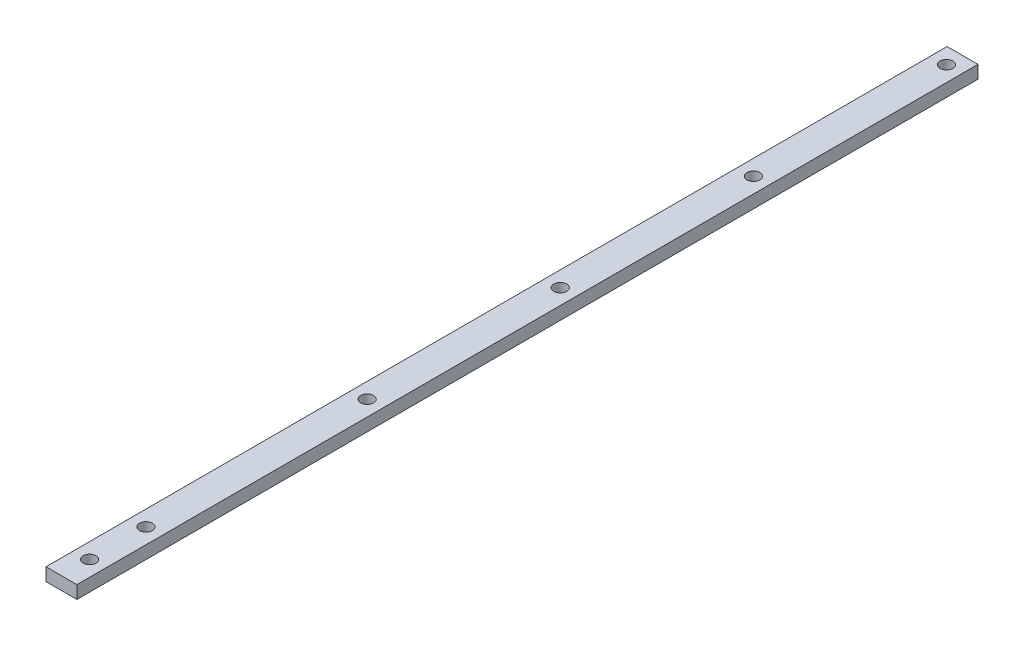
ISO-10303-21;
HEADER;
FILE_DESCRIPTION(('STEP AP214'),'2;1');
FILE_NAME('part.step','',(''),(''),'','','');
FILE_SCHEMA(('AUTOMOTIVE_DESIGN { 1 0 10303 214 1 1 1 1 }'));
ENDSEC;
DATA;
#1=APPLICATION_CONTEXT('core data for automotive mechanical design processes');
#2=APPLICATION_PROTOCOL_DEFINITION('international standard','automotive_design',2000,#1);
#3=PRODUCT_CONTEXT('',#1,'mechanical');
#4=PRODUCT('Part','Part','',(#3));
#5=PRODUCT_RELATED_PRODUCT_CATEGORY('part','',(#4));
#6=PRODUCT_DEFINITION_FORMATION('','',#4);
#7=PRODUCT_DEFINITION_CONTEXT('part definition',#1,'design');
#8=PRODUCT_DEFINITION('design','',#6,#7);
#9=PRODUCT_DEFINITION_SHAPE('','',#8);
#10=(LENGTH_UNIT() NAMED_UNIT(*) SI_UNIT(.MILLI.,.METRE.));
#11=(NAMED_UNIT(*) PLANE_ANGLE_UNIT() SI_UNIT($,.RADIAN.));
#12=(NAMED_UNIT(*) SI_UNIT($,.STERADIAN.) SOLID_ANGLE_UNIT());
#13=UNCERTAINTY_MEASURE_WITH_UNIT(LENGTH_MEASURE(1.E-05),#10,'distance_accuracy_value','');
#14=(GEOMETRIC_REPRESENTATION_CONTEXT(3) GLOBAL_UNCERTAINTY_ASSIGNED_CONTEXT((#13)) GLOBAL_UNIT_ASSIGNED_CONTEXT((#10,
#11,#12)) REPRESENTATION_CONTEXT('',''));
#15=CARTESIAN_POINT('',(0.,0.,0.));
#16=DIRECTION('',(0.,0.,1.));
#17=DIRECTION('',(1.,0.,0.));
#18=AXIS2_PLACEMENT_3D('',#15,#16,#17);
#19=CARTESIAN_POINT('',(-56.5626148851493,-2.09999999999995,-41.4745215954879));
#20=DIRECTION('',(0.,-1.,0.));
#21=DIRECTION('',(-1.,0.,0.));
#22=AXIS2_PLACEMENT_3D('',#19,#20,#21);
#23=CYLINDRICAL_SURFACE('',#22,1.);
#24=CARTESIAN_POINT('',(-56.5626148851493,-0.099999999999951,-41.4745215954879));
#25=DIRECTION('',(0.,-1.,0.));
#26=DIRECTION('',(-1.,0.,0.));
#27=AXIS2_PLACEMENT_3D('',#24,#25,#26);
#28=CIRCLE('',#27,1.);
#29=CARTESIAN_POINT('',(-55.5626148851493,-0.0999999999999504,-41.4745215954879));
#30=VERTEX_POINT('',#29);
#31=EDGE_CURVE('E33',#30,#30,#28,.T.);
#32=ORIENTED_EDGE('',*,*,#31,.F.);
#33=EDGE_LOOP('',(#32));
#34=FACE_BOUND('',#33,.T.);
#35=CARTESIAN_POINT('',(-56.5626148851493,-2.09999999999995,-41.4745215954879));
#36=DIRECTION('',(0.,-1.,0.));
#37=DIRECTION('',(-1.,0.,0.));
#38=AXIS2_PLACEMENT_3D('',#35,#36,#37);
#39=CIRCLE('',#38,1.);
#40=CARTESIAN_POINT('',(-55.5626148851493,-2.09999999999995,-41.4745215954879));
#41=VERTEX_POINT('',#40);
#42=EDGE_CURVE('E11',#41,#41,#39,.T.);
#43=ORIENTED_EDGE('',*,*,#42,.T.);
#44=EDGE_LOOP('',(#43));
#45=FACE_BOUND('',#44,.T.);
#46=ADVANCED_FACE('F16',(#34,#45),#23,.F.);
#47=CARTESIAN_POINT('',(-56.5626148851493,-2.09999999999995,-32.7245215954879));
#48=DIRECTION('',(0.,-1.,0.));
#49=DIRECTION('',(-1.,0.,0.));
#50=AXIS2_PLACEMENT_3D('',#47,#48,#49);
#51=CYLINDRICAL_SURFACE('',#50,1.);
#52=CARTESIAN_POINT('',(-56.5626148851493,-0.099999999999951,-32.7245215954879));
#53=DIRECTION('',(0.,-1.,0.));
#54=DIRECTION('',(-1.,0.,0.));
#55=AXIS2_PLACEMENT_3D('',#52,#53,#54);
#56=CIRCLE('',#55,1.);
#57=CARTESIAN_POINT('',(-55.5626148851493,-0.0999999999999504,-32.7245215954879));
#58=VERTEX_POINT('',#57);
#59=EDGE_CURVE('E129',#58,#58,#56,.T.);
#60=ORIENTED_EDGE('',*,*,#59,.F.);
#61=EDGE_LOOP('',(#60));
#62=FACE_BOUND('',#61,.T.);
#63=CARTESIAN_POINT('',(-56.5626148851493,-2.09999999999995,-32.7245215954879));
#64=DIRECTION('',(0.,-1.,0.));
#65=DIRECTION('',(-1.,0.,0.));
#66=AXIS2_PLACEMENT_3D('',#63,#64,#65);
#67=CIRCLE('',#66,1.);
#68=CARTESIAN_POINT('',(-55.5626148851493,-2.09999999999995,-32.7245215954879));
#69=VERTEX_POINT('',#68);
#70=EDGE_CURVE('E26',#69,#69,#67,.T.);
#71=ORIENTED_EDGE('',*,*,#70,.T.);
#72=EDGE_LOOP('',(#71));
#73=FACE_BOUND('',#72,.T.);
#74=ADVANCED_FACE('F184',(#62,#73),#51,.F.);
#75=CARTESIAN_POINT('',(-56.5626148851493,-2.09999999999995,-75.849521595488));
#76=DIRECTION('',(0.,-1.,0.));
#77=DIRECTION('',(-1.,0.,0.));
#78=AXIS2_PLACEMENT_3D('',#75,#76,#77);
#79=CYLINDRICAL_SURFACE('',#78,1.);
#80=CARTESIAN_POINT('',(-56.5626148851493,-0.099999999999951,-75.849521595488));
#81=DIRECTION('',(0.,-1.,0.));
#82=DIRECTION('',(-1.,0.,0.));
#83=AXIS2_PLACEMENT_3D('',#80,#81,#82);
#84=CIRCLE('',#83,1.);
#85=CARTESIAN_POINT('',(-55.5626148851493,-0.0999999999999504,-75.849521595488));
#86=VERTEX_POINT('',#85);
#87=EDGE_CURVE('E126',#86,#86,#84,.T.);
#88=ORIENTED_EDGE('',*,*,#87,.F.);
#89=EDGE_LOOP('',(#88));
#90=FACE_BOUND('',#89,.T.);
#91=CARTESIAN_POINT('',(-56.5626148851493,-2.09999999999995,-75.849521595488));
#92=DIRECTION('',(0.,-1.,0.));
#93=DIRECTION('',(-1.,0.,0.));
#94=AXIS2_PLACEMENT_3D('',#91,#92,#93);
#95=CIRCLE('',#94,1.);
#96=CARTESIAN_POINT('',(-55.5626148851493,-2.09999999999995,-75.849521595488));
#97=VERTEX_POINT('',#96);
#98=EDGE_CURVE('E91',#97,#97,#95,.T.);
#99=ORIENTED_EDGE('',*,*,#98,.T.);
#100=EDGE_LOOP('',(#99));
#101=FACE_BOUND('',#100,.T.);
#102=ADVANCED_FACE('F189',(#90,#101),#79,.F.);
#103=CARTESIAN_POINT('',(-56.5626148851493,-2.09999999999995,-105.849521595488));
#104=DIRECTION('',(0.,-1.,0.));
#105=DIRECTION('',(-1.,0.,0.));
#106=AXIS2_PLACEMENT_3D('',#103,#104,#105);
#107=CYLINDRICAL_SURFACE('',#106,1.);
#108=CARTESIAN_POINT('',(-56.5626148851493,-0.099999999999951,-105.849521595488));
#109=DIRECTION('',(0.,-1.,0.));
#110=DIRECTION('',(-1.,0.,0.));
#111=AXIS2_PLACEMENT_3D('',#108,#109,#110);
#112=CIRCLE('',#111,1.);
#113=CARTESIAN_POINT('',(-55.5626148851493,-0.0999999999999504,-105.849521595488));
#114=VERTEX_POINT('',#113);
#115=EDGE_CURVE('E103',#114,#114,#112,.T.);
#116=ORIENTED_EDGE('',*,*,#115,.F.);
#117=EDGE_LOOP('',(#116));
#118=FACE_BOUND('',#117,.T.);
#119=CARTESIAN_POINT('',(-56.5626148851493,-2.09999999999995,-105.849521595488));
#120=DIRECTION('',(0.,-1.,0.));
#121=DIRECTION('',(-1.,0.,0.));
#122=AXIS2_PLACEMENT_3D('',#119,#120,#121);
#123=CIRCLE('',#122,1.);
#124=CARTESIAN_POINT('',(-55.5626148851493,-2.09999999999995,-105.849521595488));
#125=VERTEX_POINT('',#124);
#126=EDGE_CURVE('E94',#125,#125,#123,.T.);
#127=ORIENTED_EDGE('',*,*,#126,.T.);
#128=EDGE_LOOP('',(#127));
#129=FACE_BOUND('',#128,.T.);
#130=ADVANCED_FACE('F197',(#118,#129),#107,.F.);
#131=CARTESIAN_POINT('',(-56.5626148851493,-2.09999999999995,-165.849521595488));
#132=DIRECTION('',(0.,-1.,0.));
#133=DIRECTION('',(-1.,0.,0.));
#134=AXIS2_PLACEMENT_3D('',#131,#132,#133);
#135=CYLINDRICAL_SURFACE('',#134,1.);
#136=CARTESIAN_POINT('',(-56.5626148851493,-0.099999999999951,-165.849521595488));
#137=DIRECTION('',(0.,-1.,0.));
#138=DIRECTION('',(-1.,0.,0.));
#139=AXIS2_PLACEMENT_3D('',#136,#137,#138);
#140=CIRCLE('',#139,1.);
#141=CARTESIAN_POINT('',(-55.5626148851493,-0.0999999999999504,-165.849521595488));
#142=VERTEX_POINT('',#141);
#143=EDGE_CURVE('E100',#142,#142,#140,.T.);
#144=ORIENTED_EDGE('',*,*,#143,.F.);
#145=EDGE_LOOP('',(#144));
#146=FACE_BOUND('',#145,.T.);
#147=CARTESIAN_POINT('',(-56.5626148851493,-2.09999999999995,-165.849521595488));
#148=DIRECTION('',(0.,-1.,0.));
#149=DIRECTION('',(-1.,0.,0.));
#150=AXIS2_PLACEMENT_3D('',#147,#148,#149);
#151=CIRCLE('',#150,1.);
#152=CARTESIAN_POINT('',(-55.5626148851493,-2.09999999999995,-165.849521595488));
#153=VERTEX_POINT('',#152);
#154=EDGE_CURVE('E64',#153,#153,#151,.T.);
#155=ORIENTED_EDGE('',*,*,#154,.T.);
#156=EDGE_LOOP('',(#155));
#157=FACE_BOUND('',#156,.T.);
#158=ADVANCED_FACE('F180',(#146,#157),#135,.F.);
#159=CARTESIAN_POINT('',(-56.5626148851493,-2.09999999999995,-135.849521595488));
#160=DIRECTION('',(0.,-1.,0.));
#161=DIRECTION('',(-1.,0.,0.));
#162=AXIS2_PLACEMENT_3D('',#159,#160,#161);
#163=CYLINDRICAL_SURFACE('',#162,1.);
#164=CARTESIAN_POINT('',(-56.5626148851493,-0.099999999999951,-135.849521595488));
#165=DIRECTION('',(0.,-1.,0.));
#166=DIRECTION('',(-1.,0.,0.));
#167=AXIS2_PLACEMENT_3D('',#164,#165,#166);
#168=CIRCLE('',#167,1.);
#169=CARTESIAN_POINT('',(-55.5626148851493,-0.0999999999999504,-135.849521595488));
#170=VERTEX_POINT('',#169);
#171=EDGE_CURVE('E69',#170,#170,#168,.T.);
#172=ORIENTED_EDGE('',*,*,#171,.F.);
#173=EDGE_LOOP('',(#172));
#174=FACE_BOUND('',#173,.T.);
#175=CARTESIAN_POINT('',(-56.5626148851493,-2.09999999999995,-135.849521595488));
#176=DIRECTION('',(0.,-1.,0.));
#177=DIRECTION('',(-1.,0.,0.));
#178=AXIS2_PLACEMENT_3D('',#175,#176,#177);
#179=CIRCLE('',#178,1.);
#180=CARTESIAN_POINT('',(-55.5626148851493,-2.09999999999995,-135.849521595488));
#181=VERTEX_POINT('',#180);
#182=EDGE_CURVE('E110',#181,#181,#179,.T.);
#183=ORIENTED_EDGE('',*,*,#182,.T.);
#184=EDGE_LOOP('',(#183));
#185=FACE_BOUND('',#184,.T.);
#186=ADVANCED_FACE('F172',(#174,#185),#163,.F.);
#187=CARTESIAN_POINT('',(-54.1626148851493,-2.09999999999995,-28.3495215954879));
#188=DIRECTION('',(1.,0.,0.));
#189=DIRECTION('',(0.,0.,-1.));
#190=AXIS2_PLACEMENT_3D('',#187,#188,#189);
#191=PLANE('',#190);
#192=DIRECTION('',(0.,0.,1.));
#193=VECTOR('',#192,1.);
#194=CARTESIAN_POINT('',(-54.1626148851493,-2.09999999999995,-168.349521595488));
#195=LINE('',#194,#193);
#196=CARTESIAN_POINT('',(-54.1626148851493,-2.09999999999995,-168.349521595488));
#197=VERTEX_POINT('',#196);
#198=CARTESIAN_POINT('',(-54.1626148851493,-2.09999999999995,-28.3495215954879));
#199=VERTEX_POINT('',#198);
#200=EDGE_CURVE('E136',#197,#199,#195,.T.);
#201=ORIENTED_EDGE('',*,*,#200,.F.);
#202=DIRECTION('',(0.,1.,0.));
#203=VECTOR('',#202,1.);
#204=CARTESIAN_POINT('',(-54.1626148851493,-2.09999999999995,-168.349521595488));
#205=LINE('',#204,#203);
#206=CARTESIAN_POINT('',(-54.1626148851493,-0.0999999999999496,-168.349521595488));
#207=VERTEX_POINT('',#206);
#208=EDGE_CURVE('E107',#197,#207,#205,.T.);
#209=ORIENTED_EDGE('',*,*,#208,.T.);
#210=DIRECTION('',(0.,0.,-1.));
#211=VECTOR('',#210,1.);
#212=CARTESIAN_POINT('',(-54.1626148851493,-0.0999999999999496,-168.349521595488));
#213=LINE('',#212,#211);
#214=CARTESIAN_POINT('',(-54.1626148851493,-0.0999999999999496,-28.3495215954879));
#215=VERTEX_POINT('',#214);
#216=EDGE_CURVE('E123',#215,#207,#213,.T.);
#217=ORIENTED_EDGE('',*,*,#216,.F.);
#218=DIRECTION('',(0.,1.,0.));
#219=VECTOR('',#218,1.);
#220=CARTESIAN_POINT('',(-54.1626148851493,-2.09999999999995,-28.3495215954879));
#221=LINE('',#220,#219);
#222=EDGE_CURVE('E20',#199,#215,#221,.T.);
#223=ORIENTED_EDGE('',*,*,#222,.F.);
#224=EDGE_LOOP('',(#201,#209,#217,#223));
#225=FACE_BOUND('',#224,.T.);
#226=ADVANCED_FACE('F170',(#225),#191,.T.);
#227=CARTESIAN_POINT('',(-58.9626148851493,-2.09999999999995,-28.3495215954879));
#228=DIRECTION('',(0.,0.,1.));
#229=DIRECTION('',(1.,0.,0.));
#230=AXIS2_PLACEMENT_3D('',#227,#228,#229);
#231=PLANE('',#230);
#232=DIRECTION('',(-1.,0.,0.));
#233=VECTOR('',#232,1.);
#234=CARTESIAN_POINT('',(-54.1626148851493,-2.09999999999995,-28.3495215954879));
#235=LINE('',#234,#233);
#236=CARTESIAN_POINT('',(-58.9626148851493,-2.09999999999995,-28.3495215954879));
#237=VERTEX_POINT('',#236);
#238=EDGE_CURVE('E117',#199,#237,#235,.T.);
#239=ORIENTED_EDGE('',*,*,#238,.F.);
#240=ORIENTED_EDGE('',*,*,#222,.T.);
#241=DIRECTION('',(1.,0.,0.));
#242=VECTOR('',#241,1.);
#243=CARTESIAN_POINT('',(-54.1626148851493,-0.0999999999999496,-28.3495215954879));
#244=LINE('',#243,#242);
#245=CARTESIAN_POINT('',(-58.9626148851493,-0.0999999999999526,-28.3495215954879));
#246=VERTEX_POINT('',#245);
#247=EDGE_CURVE('E122',#246,#215,#244,.T.);
#248=ORIENTED_EDGE('',*,*,#247,.F.);
#249=DIRECTION('',(0.,1.,0.));
#250=VECTOR('',#249,1.);
#251=CARTESIAN_POINT('',(-58.9626148851493,-2.09999999999995,-28.3495215954879));
#252=LINE('',#251,#250);
#253=EDGE_CURVE('E111',#237,#246,#252,.T.);
#254=ORIENTED_EDGE('',*,*,#253,.F.);
#255=EDGE_LOOP('',(#239,#240,#248,#254));
#256=FACE_BOUND('',#255,.T.);
#257=ADVANCED_FACE('F168',(#256),#231,.T.);
#258=CARTESIAN_POINT('',(-58.9626148851493,-2.09999999999995,-168.349521595488));
#259=DIRECTION('',(-1.,0.,0.));
#260=DIRECTION('',(0.,0.,1.));
#261=AXIS2_PLACEMENT_3D('',#258,#259,#260);
#262=PLANE('',#261);
#263=DIRECTION('',(0.,0.,-1.));
#264=VECTOR('',#263,1.);
#265=CARTESIAN_POINT('',(-58.9626148851493,-2.09999999999995,-28.3495215954879));
#266=LINE('',#265,#264);
#267=CARTESIAN_POINT('',(-58.9626148851493,-2.09999999999995,-168.349521595488));
#268=VERTEX_POINT('',#267);
#269=EDGE_CURVE('E114',#237,#268,#266,.T.);
#270=ORIENTED_EDGE('',*,*,#269,.F.);
#271=ORIENTED_EDGE('',*,*,#253,.T.);
#272=DIRECTION('',(0.,0.,1.));
#273=VECTOR('',#272,1.);
#274=CARTESIAN_POINT('',(-58.9626148851493,-0.0999999999999526,-28.3495215954879));
#275=LINE('',#274,#273);
#276=CARTESIAN_POINT('',(-58.9626148851493,-0.0999999999999526,-168.349521595488));
#277=VERTEX_POINT('',#276);
#278=EDGE_CURVE('E118',#277,#246,#275,.T.);
#279=ORIENTED_EDGE('',*,*,#278,.F.);
#280=DIRECTION('',(0.,1.,0.));
#281=VECTOR('',#280,1.);
#282=CARTESIAN_POINT('',(-58.9626148851493,-2.09999999999995,-168.349521595488));
#283=LINE('',#282,#281);
#284=EDGE_CURVE('E98',#268,#277,#283,.T.);
#285=ORIENTED_EDGE('',*,*,#284,.F.);
#286=EDGE_LOOP('',(#270,#271,#279,#285));
#287=FACE_BOUND('',#286,.T.);
#288=ADVANCED_FACE('F163',(#287),#262,.T.);
#289=CARTESIAN_POINT('',(-54.1626148851493,-2.09999999999995,-168.349521595488));
#290=DIRECTION('',(0.,0.,-1.));
#291=DIRECTION('',(-1.,0.,0.));
#292=AXIS2_PLACEMENT_3D('',#289,#290,#291);
#293=PLANE('',#292);
#294=DIRECTION('',(1.,0.,0.));
#295=VECTOR('',#294,1.);
#296=CARTESIAN_POINT('',(-58.9626148851493,-2.09999999999995,-168.349521595488));
#297=LINE('',#296,#295);
#298=EDGE_CURVE('E124',#268,#197,#297,.T.);
#299=ORIENTED_EDGE('',*,*,#298,.F.);
#300=ORIENTED_EDGE('',*,*,#284,.T.);
#301=DIRECTION('',(-1.,0.,0.));
#302=VECTOR('',#301,1.);
#303=CARTESIAN_POINT('',(-58.9626148851493,-0.0999999999999526,-168.349521595488));
#304=LINE('',#303,#302);
#305=EDGE_CURVE('E121',#207,#277,#304,.T.);
#306=ORIENTED_EDGE('',*,*,#305,.F.);
#307=ORIENTED_EDGE('',*,*,#208,.F.);
#308=EDGE_LOOP('',(#299,#300,#306,#307));
#309=FACE_BOUND('',#308,.T.);
#310=ADVANCED_FACE('F18',(#309),#293,.T.);
#311=CARTESIAN_POINT('',(-56.5626148851493,-0.099999999999951,-98.349521595488));
#312=DIRECTION('',(0.,1.,0.));
#313=DIRECTION('',(-1.,0.,0.));
#314=AXIS2_PLACEMENT_3D('',#311,#312,#313);
#315=PLANE('',#314);
#316=ORIENTED_EDGE('',*,*,#171,.T.);
#317=EDGE_LOOP('',(#316));
#318=FACE_BOUND('',#317,.T.);
#319=ORIENTED_EDGE('',*,*,#143,.T.);
#320=EDGE_LOOP('',(#319));
#321=FACE_BOUND('',#320,.T.);
#322=ORIENTED_EDGE('',*,*,#115,.T.);
#323=EDGE_LOOP('',(#322));
#324=FACE_BOUND('',#323,.T.);
#325=ORIENTED_EDGE('',*,*,#87,.T.);
#326=EDGE_LOOP('',(#325));
#327=FACE_BOUND('',#326,.T.);
#328=ORIENTED_EDGE('',*,*,#59,.T.);
#329=EDGE_LOOP('',(#328));
#330=FACE_BOUND('',#329,.T.);
#331=ORIENTED_EDGE('',*,*,#31,.T.);
#332=EDGE_LOOP('',(#331));
#333=FACE_BOUND('',#332,.T.);
#334=ORIENTED_EDGE('',*,*,#305,.T.);
#335=ORIENTED_EDGE('',*,*,#278,.T.);
#336=ORIENTED_EDGE('',*,*,#247,.T.);
#337=ORIENTED_EDGE('',*,*,#216,.T.);
#338=EDGE_LOOP('',(#334,#335,#336,#337));
#339=FACE_BOUND('',#338,.T.);
#340=ADVANCED_FACE('F154',(#318,#321,#324,#327,#330,#333,#339),#315,.T.);
#341=CARTESIAN_POINT('',(-56.5626148851493,-2.09999999999995,-98.349521595488));
#342=DIRECTION('',(0.,1.,0.));
#343=DIRECTION('',(-1.,0.,0.));
#344=AXIS2_PLACEMENT_3D('',#341,#342,#343);
#345=PLANE('',#344);
#346=ORIENTED_EDGE('',*,*,#182,.F.);
#347=EDGE_LOOP('',(#346));
#348=FACE_BOUND('',#347,.T.);
#349=ORIENTED_EDGE('',*,*,#154,.F.);
#350=EDGE_LOOP('',(#349));
#351=FACE_BOUND('',#350,.T.);
#352=ORIENTED_EDGE('',*,*,#126,.F.);
#353=EDGE_LOOP('',(#352));
#354=FACE_BOUND('',#353,.T.);
#355=ORIENTED_EDGE('',*,*,#98,.F.);
#356=EDGE_LOOP('',(#355));
#357=FACE_BOUND('',#356,.T.);
#358=ORIENTED_EDGE('',*,*,#70,.F.);
#359=EDGE_LOOP('',(#358));
#360=FACE_BOUND('',#359,.T.);
#361=ORIENTED_EDGE('',*,*,#42,.F.);
#362=EDGE_LOOP('',(#361));
#363=FACE_BOUND('',#362,.T.);
#364=ORIENTED_EDGE('',*,*,#298,.T.);
#365=ORIENTED_EDGE('',*,*,#200,.T.);
#366=ORIENTED_EDGE('',*,*,#238,.T.);
#367=ORIENTED_EDGE('',*,*,#269,.T.);
#368=EDGE_LOOP('',(#364,#365,#366,#367));
#369=FACE_BOUND('',#368,.T.);
#370=ADVANCED_FACE('F88',(#348,#351,#354,#357,#360,#363,#369),#345,.F.);
#371=CLOSED_SHELL('',(#46,#74,#102,#130,#158,#186,#226,#257,#288,#310,#340,#370));
#372=MANIFOLD_SOLID_BREP('B1',#371);
#373=ADVANCED_BREP_SHAPE_REPRESENTATION('',(#18,#372),#14);
#374=SHAPE_DEFINITION_REPRESENTATION(#9,#373);
ENDSEC;
END-ISO-10303-21;
